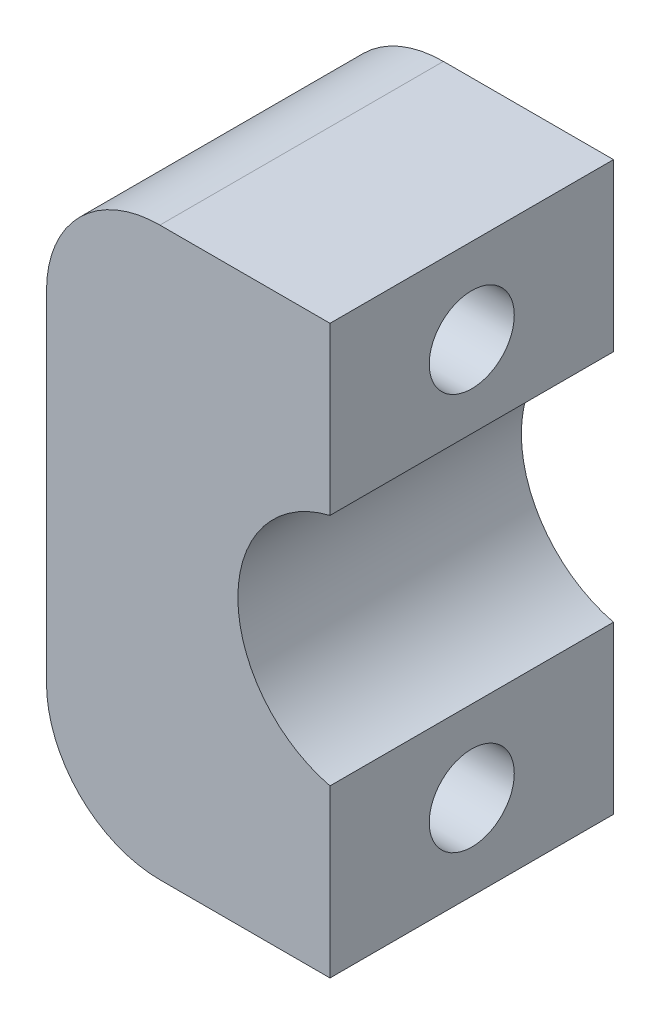
ISO-10303-21;
HEADER;
FILE_DESCRIPTION(('STEP AP214'),'2;1');
FILE_NAME('part.step','',(''),(''),'','','');
FILE_SCHEMA(('AUTOMOTIVE_DESIGN { 1 0 10303 214 1 1 1 1 }'));
ENDSEC;
DATA;
#1=APPLICATION_CONTEXT('core data for automotive mechanical design processes');
#2=APPLICATION_PROTOCOL_DEFINITION('international standard','automotive_design',2000,#1);
#3=PRODUCT_CONTEXT('',#1,'mechanical');
#4=PRODUCT('Part','Part','',(#3));
#5=PRODUCT_RELATED_PRODUCT_CATEGORY('part','',(#4));
#6=PRODUCT_DEFINITION_FORMATION('','',#4);
#7=PRODUCT_DEFINITION_CONTEXT('part definition',#1,'design');
#8=PRODUCT_DEFINITION('design','',#6,#7);
#9=PRODUCT_DEFINITION_SHAPE('','',#8);
#10=(LENGTH_UNIT() NAMED_UNIT(*) SI_UNIT(.MILLI.,.METRE.));
#11=(NAMED_UNIT(*) PLANE_ANGLE_UNIT() SI_UNIT($,.RADIAN.));
#12=(NAMED_UNIT(*) SI_UNIT($,.STERADIAN.) SOLID_ANGLE_UNIT());
#13=UNCERTAINTY_MEASURE_WITH_UNIT(LENGTH_MEASURE(1.E-05),#10,'distance_accuracy_value','');
#14=(GEOMETRIC_REPRESENTATION_CONTEXT(3) GLOBAL_UNCERTAINTY_ASSIGNED_CONTEXT((#13)) GLOBAL_UNIT_ASSIGNED_CONTEXT((#10,
#11,#12)) REPRESENTATION_CONTEXT('',''));
#15=CARTESIAN_POINT('',(0.,0.,0.));
#16=DIRECTION('',(0.,0.,1.));
#17=DIRECTION('',(1.,0.,0.));
#18=AXIS2_PLACEMENT_3D('',#15,#16,#17);
#19=CARTESIAN_POINT('',(5.,20.,5.));
#20=DIRECTION('',(-1.,0.,0.));
#21=DIRECTION('',(0.,0.,1.));
#22=AXIS2_PLACEMENT_3D('',#19,#20,#21);
#23=PLANE('',#22);
#24=CARTESIAN_POINT('',(5.,3.,0.));
#25=DIRECTION('',(1.,0.,0.));
#26=DIRECTION('',(0.,0.,-1.));
#27=AXIS2_PLACEMENT_3D('',#24,#25,#26);
#28=CIRCLE('',#27,1.5);
#29=CARTESIAN_POINT('',(5.,3.,-1.5));
#30=VERTEX_POINT('',#29);
#31=EDGE_CURVE('E228',#30,#30,#28,.T.);
#32=ORIENTED_EDGE('',*,*,#31,.F.);
#33=EDGE_LOOP('',(#32));
#34=FACE_BOUND('',#33,.T.);
#35=DIRECTION('',(0.,-1.,0.));
#36=VECTOR('',#35,1.);
#37=CARTESIAN_POINT('',(5.,20.,-5.));
#38=LINE('',#37,#36);
#39=CARTESIAN_POINT('',(5.,5.86932208953542,-5.));
#40=VERTEX_POINT('',#39);
#41=CARTESIAN_POINT('',(5.,0.,-5.));
#42=VERTEX_POINT('',#41);
#43=EDGE_CURVE('E140',#40,#42,#38,.T.);
#44=ORIENTED_EDGE('',*,*,#43,.F.);
#45=DIRECTION('',(0.,0.,1.));
#46=VECTOR('',#45,1.);
#47=CARTESIAN_POINT('',(5.,5.86932208953542,-5.));
#48=LINE('',#47,#46);
#49=CARTESIAN_POINT('',(5.,5.86932208953542,5.));
#50=VERTEX_POINT('',#49);
#51=EDGE_CURVE('E121',#40,#50,#48,.T.);
#52=ORIENTED_EDGE('',*,*,#51,.T.);
#53=DIRECTION('',(0.,-1.,0.));
#54=VECTOR('',#53,1.);
#55=CARTESIAN_POINT('',(5.,20.,5.));
#56=LINE('',#55,#54);
#57=CARTESIAN_POINT('',(5.,0.,5.));
#58=VERTEX_POINT('',#57);
#59=EDGE_CURVE('E139',#50,#58,#56,.T.);
#60=ORIENTED_EDGE('',*,*,#59,.T.);
#61=DIRECTION('',(0.,0.,-1.));
#62=VECTOR('',#61,1.);
#63=CARTESIAN_POINT('',(5.,0.,5.));
#64=LINE('',#63,#62);
#65=EDGE_CURVE('E243',#58,#42,#64,.T.);
#66=ORIENTED_EDGE('',*,*,#65,.T.);
#67=EDGE_LOOP('',(#44,#52,#60,#66));
#68=FACE_BOUND('',#67,.T.);
#69=ADVANCED_FACE('F37',(#34,#68),#23,.F.);
#70=CARTESIAN_POINT('',(-5.,20.,5.));
#71=DIRECTION('',(1.,0.,0.));
#72=DIRECTION('',(0.,0.,-1.));
#73=AXIS2_PLACEMENT_3D('',#70,#71,#72);
#74=PLANE('',#73);
#75=DIRECTION('',(0.,-1.,0.));
#76=VECTOR('',#75,1.);
#77=CARTESIAN_POINT('',(-5.,20.,5.));
#78=LINE('',#77,#76);
#79=CARTESIAN_POINT('',(-5.,16.,5.));
#80=VERTEX_POINT('',#79);
#81=CARTESIAN_POINT('',(-5.,4.,5.));
#82=VERTEX_POINT('',#81);
#83=EDGE_CURVE('E148',#80,#82,#78,.T.);
#84=ORIENTED_EDGE('',*,*,#83,.F.);
#85=DIRECTION('',(0.,0.,1.));
#86=VECTOR('',#85,1.);
#87=CARTESIAN_POINT('',(-5.,16.,-5.));
#88=LINE('',#87,#86);
#89=CARTESIAN_POINT('',(-5.,16.,1.1180339887499));
#90=VERTEX_POINT('',#89);
#91=EDGE_CURVE('E165',#80,#90,#88,.F.);
#92=ORIENTED_EDGE('',*,*,#91,.T.);
#93=CARTESIAN_POINT('',(-5.,17.,0.));
#94=DIRECTION('',(1.,0.,0.));
#95=DIRECTION('',(0.,0.,-1.));
#96=AXIS2_PLACEMENT_3D('',#93,#94,#95);
#97=CIRCLE('',#96,1.5);
#98=CARTESIAN_POINT('',(-5.,16.,-1.1180339887499));
#99=VERTEX_POINT('',#98);
#100=EDGE_CURVE('E224',#90,#99,#97,.T.);
#101=ORIENTED_EDGE('',*,*,#100,.T.);
#102=DIRECTION('',(0.,0.,1.));
#103=VECTOR('',#102,1.);
#104=CARTESIAN_POINT('',(-5.,16.,-5.));
#105=LINE('',#104,#103);
#106=CARTESIAN_POINT('',(-5.,16.,-5.));
#107=VERTEX_POINT('',#106);
#108=EDGE_CURVE('E163',#99,#107,#105,.F.);
#109=ORIENTED_EDGE('',*,*,#108,.T.);
#110=DIRECTION('',(0.,-1.,0.));
#111=VECTOR('',#110,1.);
#112=CARTESIAN_POINT('',(-5.,20.,-5.));
#113=LINE('',#112,#111);
#114=CARTESIAN_POINT('',(-5.,4.,-5.));
#115=VERTEX_POINT('',#114);
#116=EDGE_CURVE('E144',#107,#115,#113,.T.);
#117=ORIENTED_EDGE('',*,*,#116,.T.);
#118=DIRECTION('',(0.,0.,1.));
#119=VECTOR('',#118,1.);
#120=CARTESIAN_POINT('',(-5.,4.,5.));
#121=LINE('',#120,#119);
#122=CARTESIAN_POINT('',(-5.,4.,-1.11803398874989));
#123=VERTEX_POINT('',#122);
#124=EDGE_CURVE('E160',#115,#123,#121,.T.);
#125=ORIENTED_EDGE('',*,*,#124,.T.);
#126=CARTESIAN_POINT('',(-5.,3.,0.));
#127=DIRECTION('',(1.,0.,0.));
#128=DIRECTION('',(0.,0.,-1.));
#129=AXIS2_PLACEMENT_3D('',#126,#127,#128);
#130=CIRCLE('',#129,1.5);
#131=CARTESIAN_POINT('',(-5.,4.,1.11803398874989));
#132=VERTEX_POINT('',#131);
#133=EDGE_CURVE('E232',#123,#132,#130,.T.);
#134=ORIENTED_EDGE('',*,*,#133,.T.);
#135=DIRECTION('',(0.,0.,1.));
#136=VECTOR('',#135,1.);
#137=CARTESIAN_POINT('',(-5.,4.,5.));
#138=LINE('',#137,#136);
#139=EDGE_CURVE('E158',#132,#82,#138,.T.);
#140=ORIENTED_EDGE('',*,*,#139,.T.);
#141=EDGE_LOOP('',(#84,#92,#101,#109,#117,#125,#134,#140));
#142=FACE_BOUND('',#141,.T.);
#143=ADVANCED_FACE('F202',(#142),#74,.F.);
#144=CARTESIAN_POINT('',(5.,20.,5.));
#145=DIRECTION('',(0.,0.,-1.));
#146=DIRECTION('',(-1.,0.,0.));
#147=AXIS2_PLACEMENT_3D('',#144,#145,#146);
#148=PLANE('',#147);
#149=DIRECTION('',(1.,0.,0.));
#150=VECTOR('',#149,1.);
#151=CARTESIAN_POINT('',(5.,20.,5.));
#152=LINE('',#151,#150);
#153=CARTESIAN_POINT('',(-1.,20.,5.));
#154=VERTEX_POINT('',#153);
#155=CARTESIAN_POINT('',(5.,20.,5.));
#156=VERTEX_POINT('',#155);
#157=EDGE_CURVE('E236',#154,#156,#152,.T.);
#158=ORIENTED_EDGE('',*,*,#157,.F.);
#159=CARTESIAN_POINT('',(-1.,16.,5.));
#160=DIRECTION('',(0.,0.,-1.));
#161=DIRECTION('',(-1.,0.,0.));
#162=AXIS2_PLACEMENT_3D('',#159,#160,#161);
#163=CIRCLE('',#162,4.);
#164=EDGE_CURVE('E156',#154,#80,#163,.F.);
#165=ORIENTED_EDGE('',*,*,#164,.T.);
#166=ORIENTED_EDGE('',*,*,#83,.T.);
#167=CARTESIAN_POINT('',(-1.,4.,5.));
#168=DIRECTION('',(0.,0.,-1.));
#169=DIRECTION('',(-1.,0.,0.));
#170=AXIS2_PLACEMENT_3D('',#167,#168,#169);
#171=CIRCLE('',#170,4.);
#172=CARTESIAN_POINT('',(-1.,0.,5.));
#173=VERTEX_POINT('',#172);
#174=EDGE_CURVE('E154',#82,#173,#171,.F.);
#175=ORIENTED_EDGE('',*,*,#174,.T.);
#176=DIRECTION('',(1.,0.,0.));
#177=VECTOR('',#176,1.);
#178=CARTESIAN_POINT('',(5.,0.,5.));
#179=LINE('',#178,#177);
#180=EDGE_CURVE('E235',#173,#58,#179,.T.);
#181=ORIENTED_EDGE('',*,*,#180,.T.);
#182=ORIENTED_EDGE('',*,*,#59,.F.);
#183=CARTESIAN_POINT('',(6.,10.,5.));
#184=DIRECTION('',(0.,0.,1.));
#185=DIRECTION('',(1.,0.,0.));
#186=AXIS2_PLACEMENT_3D('',#183,#184,#185);
#187=CIRCLE('',#186,4.25);
#188=CARTESIAN_POINT('',(5.,14.1306779104646,5.));
#189=VERTEX_POINT('',#188);
#190=EDGE_CURVE('E124',#189,#50,#187,.T.);
#191=ORIENTED_EDGE('',*,*,#190,.F.);
#192=EDGE_CURVE('E134',#156,#189,#56,.T.);
#193=ORIENTED_EDGE('',*,*,#192,.F.);
#194=EDGE_LOOP('',(#158,#165,#166,#175,#181,#182,#191,#193));
#195=FACE_BOUND('',#194,.T.);
#196=ADVANCED_FACE('F199',(#195),#148,.F.);
#197=CARTESIAN_POINT('',(5.,17.,0.));
#198=DIRECTION('',(1.,0.,0.));
#199=DIRECTION('',(0.,0.,-1.));
#200=AXIS2_PLACEMENT_3D('',#197,#198,#199);
#201=CIRCLE('',#200,1.5);
#202=CARTESIAN_POINT('',(5.,17.,-1.5));
#203=VERTEX_POINT('',#202);
#204=EDGE_CURVE('E225',#203,#203,#201,.T.);
#205=ORIENTED_EDGE('',*,*,#204,.F.);
#206=EDGE_LOOP('',(#205));
#207=FACE_BOUND('',#206,.T.);
#208=ORIENTED_EDGE('',*,*,#192,.T.);
#209=DIRECTION('',(0.,0.,1.));
#210=VECTOR('',#209,1.);
#211=CARTESIAN_POINT('',(5.,14.1306779104646,-5.));
#212=LINE('',#211,#210);
#213=CARTESIAN_POINT('',(5.,14.1306779104646,-5.));
#214=VERTEX_POINT('',#213);
#215=EDGE_CURVE('E118',#189,#214,#212,.F.);
#216=ORIENTED_EDGE('',*,*,#215,.T.);
#217=CARTESIAN_POINT('',(5.,20.,-5.));
#218=VERTEX_POINT('',#217);
#219=EDGE_CURVE('E131',#218,#214,#38,.T.);
#220=ORIENTED_EDGE('',*,*,#219,.F.);
#221=DIRECTION('',(0.,0.,-1.));
#222=VECTOR('',#221,1.);
#223=CARTESIAN_POINT('',(5.,20.,5.));
#224=LINE('',#223,#222);
#225=EDGE_CURVE('E238',#156,#218,#224,.T.);
#226=ORIENTED_EDGE('',*,*,#225,.F.);
#227=EDGE_LOOP('',(#208,#216,#220,#226));
#228=FACE_BOUND('',#227,.T.);
#229=ADVANCED_FACE('F129',(#207,#228),#23,.F.);
#230=CARTESIAN_POINT('',(5.,20.,-5.));
#231=DIRECTION('',(0.,0.,1.));
#232=DIRECTION('',(1.,0.,0.));
#233=AXIS2_PLACEMENT_3D('',#230,#231,#232);
#234=PLANE('',#233);
#235=ORIENTED_EDGE('',*,*,#116,.F.);
#236=CARTESIAN_POINT('',(-1.,16.,-5.));
#237=DIRECTION('',(0.,0.,1.));
#238=DIRECTION('',(1.,0.,0.));
#239=AXIS2_PLACEMENT_3D('',#236,#237,#238);
#240=CIRCLE('',#239,4.);
#241=CARTESIAN_POINT('',(-1.,20.,-5.));
#242=VERTEX_POINT('',#241);
#243=EDGE_CURVE('E248',#107,#242,#240,.F.);
#244=ORIENTED_EDGE('',*,*,#243,.T.);
#245=DIRECTION('',(-1.,0.,0.));
#246=VECTOR('',#245,1.);
#247=CARTESIAN_POINT('',(5.,20.,-5.));
#248=LINE('',#247,#246);
#249=EDGE_CURVE('E138',#218,#242,#248,.T.);
#250=ORIENTED_EDGE('',*,*,#249,.F.);
#251=ORIENTED_EDGE('',*,*,#219,.T.);
#252=CARTESIAN_POINT('',(6.,10.,-5.));
#253=DIRECTION('',(0.,0.,1.));
#254=DIRECTION('',(1.,0.,0.));
#255=AXIS2_PLACEMENT_3D('',#252,#253,#254);
#256=CIRCLE('',#255,4.25);
#257=EDGE_CURVE('E115',#214,#40,#256,.T.);
#258=ORIENTED_EDGE('',*,*,#257,.T.);
#259=ORIENTED_EDGE('',*,*,#43,.T.);
#260=DIRECTION('',(-1.,0.,0.));
#261=VECTOR('',#260,1.);
#262=CARTESIAN_POINT('',(5.,0.,-5.));
#263=LINE('',#262,#261);
#264=CARTESIAN_POINT('',(-1.,0.,-5.));
#265=VERTEX_POINT('',#264);
#266=EDGE_CURVE('E239',#42,#265,#263,.T.);
#267=ORIENTED_EDGE('',*,*,#266,.T.);
#268=CARTESIAN_POINT('',(-1.,4.,-5.));
#269=DIRECTION('',(0.,0.,1.));
#270=DIRECTION('',(1.,0.,0.));
#271=AXIS2_PLACEMENT_3D('',#268,#269,#270);
#272=CIRCLE('',#271,4.);
#273=EDGE_CURVE('E58',#265,#115,#272,.F.);
#274=ORIENTED_EDGE('',*,*,#273,.T.);
#275=EDGE_LOOP('',(#235,#244,#250,#251,#258,#259,#267,#274));
#276=FACE_BOUND('',#275,.T.);
#277=ADVANCED_FACE('F136',(#276),#234,.F.);
#278=CARTESIAN_POINT('',(0.,20.,0.));
#279=DIRECTION('',(0.,1.,0.));
#280=DIRECTION('',(0.,0.,1.));
#281=AXIS2_PLACEMENT_3D('',#278,#279,#280);
#282=PLANE('',#281);
#283=ORIENTED_EDGE('',*,*,#249,.T.);
#284=DIRECTION('',(0.,0.,1.));
#285=VECTOR('',#284,1.);
#286=CARTESIAN_POINT('',(-1.,20.,5.));
#287=LINE('',#286,#285);
#288=EDGE_CURVE('E151',#242,#154,#287,.T.);
#289=ORIENTED_EDGE('',*,*,#288,.T.);
#290=ORIENTED_EDGE('',*,*,#157,.T.);
#291=ORIENTED_EDGE('',*,*,#225,.T.);
#292=EDGE_LOOP('',(#283,#289,#290,#291));
#293=FACE_BOUND('',#292,.T.);
#294=ADVANCED_FACE('F189',(#293),#282,.T.);
#295=CARTESIAN_POINT('',(0.,0.,0.));
#296=DIRECTION('',(0.,1.,0.));
#297=DIRECTION('',(0.,0.,1.));
#298=AXIS2_PLACEMENT_3D('',#295,#296,#297);
#299=PLANE('',#298);
#300=ORIENTED_EDGE('',*,*,#180,.F.);
#301=DIRECTION('',(0.,0.,1.));
#302=VECTOR('',#301,1.);
#303=CARTESIAN_POINT('',(-1.,0.,0.));
#304=LINE('',#303,#302);
#305=EDGE_CURVE('E11',#173,#265,#304,.F.);
#306=ORIENTED_EDGE('',*,*,#305,.T.);
#307=ORIENTED_EDGE('',*,*,#266,.F.);
#308=ORIENTED_EDGE('',*,*,#65,.F.);
#309=EDGE_LOOP('',(#300,#306,#307,#308));
#310=FACE_BOUND('',#309,.T.);
#311=ADVANCED_FACE('F188',(#310),#299,.F.);
#312=CARTESIAN_POINT('',(6.,10.,-5.));
#313=DIRECTION('',(0.,0.,1.));
#314=DIRECTION('',(1.,0.,0.));
#315=AXIS2_PLACEMENT_3D('',#312,#313,#314);
#316=CYLINDRICAL_SURFACE('',#315,4.25);
#317=ORIENTED_EDGE('',*,*,#257,.F.);
#318=ORIENTED_EDGE('',*,*,#215,.F.);
#319=ORIENTED_EDGE('',*,*,#190,.T.);
#320=ORIENTED_EDGE('',*,*,#51,.F.);
#321=EDGE_LOOP('',(#317,#318,#319,#320));
#322=FACE_BOUND('',#321,.T.);
#323=ADVANCED_FACE('F117',(#322),#316,.F.);
#324=CARTESIAN_POINT('',(-5.,17.,0.));
#325=DIRECTION('',(1.,0.,0.));
#326=DIRECTION('',(0.,0.,-1.));
#327=AXIS2_PLACEMENT_3D('',#324,#325,#326);
#328=CYLINDRICAL_SURFACE('',#327,1.5);
#329=ORIENTED_EDGE('',*,*,#100,.F.);
#330=CARTESIAN_POINT('',(-5.,16.,1.1180339887499));
#331=CARTESIAN_POINT('',(-5.00000022119775,16.0301472354193,1.1449986596154));
#332=CARTESIAN_POINT('',(-4.9996586547776,16.0613733970829,1.1707315150769));
#333=CARTESIAN_POINT('',(-4.99815165725793,16.1257902084972,1.21958733550074));
#334=CARTESIAN_POINT('',(-4.99698614585624,16.1589810494377,1.24271004582205));
#335=CARTESIAN_POINT('',(-4.99204914070297,16.2610805053327,1.30785888402432));
#336=CARTESIAN_POINT('',(-4.98683816564392,16.3326243679681,1.34576238111664));
#337=CARTESIAN_POINT('',(-4.97172941371885,16.4805189745722,1.4094819468788));
#338=CARTESIAN_POINT('',(-4.96182554652281,16.5568758528011,1.43528222142185));
#339=CARTESIAN_POINT('',(-4.93692067545343,16.71190629951,1.47424015670582));
#340=CARTESIAN_POINT('',(-4.92192227781528,16.790578664686,1.48740426864538));
#341=CARTESIAN_POINT('',(-4.88702718487261,16.9473248318172,1.50112474564526));
#342=CARTESIAN_POINT('',(-4.8671656116747,17.0253989589847,1.50176896089076));
#343=CARTESIAN_POINT('',(-4.8229933446876,17.1794718386795,1.49122752467265));
#344=CARTESIAN_POINT('',(-4.7986802168678,17.2554694295394,1.48003538523287));
#345=CARTESIAN_POINT('',(-4.74493337665097,17.4079709236681,1.44568953899924));
#346=CARTESIAN_POINT('',(-4.71528512136644,17.4842509138375,1.42188277053331));
#347=CARTESIAN_POINT('',(-4.65319458606603,17.6311153258216,1.36306932159568));
#348=CARTESIAN_POINT('',(-4.62075161519092,17.7016983309294,1.32805986595777));
#349=CARTESIAN_POINT('',(-4.55091225478773,17.8433406390253,1.24350115665281));
#350=CARTESIAN_POINT('',(-4.51335889074114,17.9136311293903,1.19279138821912));
#351=CARTESIAN_POINT('',(-4.43872137132709,18.0447245972482,1.07983767727731));
#352=CARTESIAN_POINT('',(-4.40163794818834,18.1055141252558,1.01757765197095));
#353=CARTESIAN_POINT('',(-4.32853406273424,18.2193903184475,0.878430228684703));
#354=CARTESIAN_POINT('',(-4.29270119801716,18.2718224308868,0.800902238815065));
#355=CARTESIAN_POINT('',(-4.22850332321898,18.3621706095598,0.635092518520685));
#356=CARTESIAN_POINT('',(-4.2001178546376,18.4001265758606,0.54684124387886));
#357=CARTESIAN_POINT('',(-4.16218540099348,18.4497420964714,0.390789649514078));
#358=CARTESIAN_POINT('',(-4.14952496994344,18.4659090338344,0.325169173811443));
#359=CARTESIAN_POINT('',(-4.13108993667224,18.4892777820119,0.191426328657126));
#360=CARTESIAN_POINT('',(-4.12530772612916,18.4964894990037,0.123306809688897));
#361=CARTESIAN_POINT('',(-4.12129440037009,18.5015062876114,-0.0136651647102532));
#362=CARTESIAN_POINT('',(-4.1230809059247,18.4992894084127,-0.0825189578128557));
#363=CARTESIAN_POINT('',(-4.13402533335742,18.4855497570238,-0.218703818834312));
#364=CARTESIAN_POINT('',(-4.14318716759518,18.4740220457449,-0.28603405906623));
#365=CARTESIAN_POINT('',(-4.16757578167227,18.4427117848218,-0.415867536051533));
#366=CARTESIAN_POINT('',(-4.18265938444092,18.4231236190427,-0.47844586371281));
#367=CARTESIAN_POINT('',(-4.21756557986445,18.3765764138889,-0.59936661036021));
#368=CARTESIAN_POINT('',(-4.23738983527228,18.3496147878435,-0.657707533723138));
#369=CARTESIAN_POINT('',(-4.28378468012632,18.2844239279232,-0.778237607114462));
#370=CARTESIAN_POINT('',(-4.31092518127944,18.2450934572255,-0.839609161776513));
#371=CARTESIAN_POINT('',(-4.36787452305173,18.1587269884118,-0.955285619457794));
#372=CARTESIAN_POINT('',(-4.39768533260032,18.1116852829134,-1.00958523443565));
#373=CARTESIAN_POINT('',(-4.46443386773047,18.0006684753754,-1.12071100554385));
#374=CARTESIAN_POINT('',(-4.50161105146883,17.9351858738484,-1.17589664120707));
#375=CARTESIAN_POINT('',(-4.57524832125866,17.7955059435488,-1.27455348846475));
#376=CARTESIAN_POINT('',(-4.61170794273817,17.721303172584,-1.3180173282315));
#377=CARTESIAN_POINT('',(-4.6843499569096,17.5600946693997,-1.39455595464622));
#378=CARTESIAN_POINT('',(-4.72034061460376,17.4725592875636,-1.42670998672802));
#379=CARTESIAN_POINT('',(-4.78710036380514,17.291193594396,-1.47444177871588));
#380=CARTESIAN_POINT('',(-4.81787337152072,17.1973680787199,-1.49003201759954));
#381=CARTESIAN_POINT('',(-4.8702723630493,17.0145278298705,-1.5024861213145));
#382=CARTESIAN_POINT('',(-4.89245026890391,16.9257729746025,-1.50081586106394));
#383=CARTESIAN_POINT('',(-4.9303638084902,16.7486164446103,-1.48146141771453));
#384=CARTESIAN_POINT('',(-4.94610241855436,16.6602146254609,-1.46378464521703));
#385=CARTESIAN_POINT('',(-4.96993477191657,16.495823677847,-1.41507022665776));
#386=CARTESIAN_POINT('',(-4.97863141212214,16.4194724673344,-1.3855297087446));
#387=CARTESIAN_POINT('',(-4.99139887472082,16.27234923917,-1.31422390942448));
#388=CARTESIAN_POINT('',(-4.99547560142535,16.2015702081535,-1.27247431746938));
#389=CARTESIAN_POINT('',(-4.99852276804927,16.1112387676309,-1.2086915924151));
#390=CARTESIAN_POINT('',(-4.99909011019411,16.0882428997008,-1.19143932092378));
#391=CARTESIAN_POINT('',(-4.99982801720677,16.0433200530381,-1.15567444163813));
#392=CARTESIAN_POINT('',(-4.99999935981009,16.0213910620886,-1.1371643778907));
#393=CARTESIAN_POINT('',(-5.00000000000001,16.,-1.1180339887499));
#394=B_SPLINE_CURVE_WITH_KNOTS('',3,(#330,#331,#332,#333,#334,#335,#336,#337,#338,#339,#340,
#341,#342,#343,#344,#345,#346,#347,#348,#349,#350,#351,#352,#353,#354,#355,#356,#357,#358,#359,
#360,#361,#362,#363,#364,#365,#366,#367,#368,#369,#370,#371,#372,#373,#374,#375,#376,#377,#378,
#379,#380,#381,#382,#383,#384,#385,#386,#387,#388,#389,#390,#391,#392,#393),.UNSPECIFIED.,.F.,
.F.,(4,2,2,2,2,2,2,2,2,2,2,2,2,2,2,2,2,2,2,2,2,2,2,2,2,2,2,2,2,2,2,4),(0.,0.121270804252288,
0.242553429258347,0.484688620106601,0.727138912826481,0.969465360337442,1.21009082180609,
1.45084824804437,1.70550056190527,1.96021600796838,2.24238846114128,2.52495680646648,
2.82397708007851,3.12216711420394,3.32758248913295,3.53277043257514,3.73843633740828,
3.94421141291872,4.14529057535962,4.34644036871567,4.57894336728253,4.81161923378278,
5.09051195982657,5.36957967441565,5.6678515817297,5.96589861461178,6.23885668817008,
6.51168845377318,6.75749124117009,7.00297953378055,7.0892038085405,7.17525859604404),.UNSPECIFIED.);
#395=EDGE_CURVE('E167',#90,#99,#394,.T.);
#396=ORIENTED_EDGE('',*,*,#395,.T.);
#397=EDGE_LOOP('',(#329,#396));
#398=FACE_BOUND('',#397,.T.);
#399=ORIENTED_EDGE('',*,*,#204,.T.);
#400=EDGE_LOOP('',(#399));
#401=FACE_BOUND('',#400,.T.);
#402=ADVANCED_FACE('F178',(#398,#401),#328,.F.);
#403=CARTESIAN_POINT('',(-5.,3.,0.));
#404=DIRECTION('',(1.,0.,0.));
#405=DIRECTION('',(0.,0.,-1.));
#406=AXIS2_PLACEMENT_3D('',#403,#404,#405);
#407=CYLINDRICAL_SURFACE('',#406,1.5);
#408=ORIENTED_EDGE('',*,*,#133,.F.);
#409=CARTESIAN_POINT('',(-5.,4.,-1.11803398874989));
#410=CARTESIAN_POINT('',(-5.00000022119775,3.96985276458074,-1.1449986596154));
#411=CARTESIAN_POINT('',(-4.9996586547776,3.93862660291712,-1.17073151507689));
#412=CARTESIAN_POINT('',(-4.99815165725793,3.87420979150282,-1.21958733550074));
#413=CARTESIAN_POINT('',(-4.99698614585624,3.84101895056226,-1.24271004582205));
#414=CARTESIAN_POINT('',(-4.99204914070297,3.73891949466728,-1.30785888402432));
#415=CARTESIAN_POINT('',(-4.98683816564392,3.66737563203189,-1.34576238111663));
#416=CARTESIAN_POINT('',(-4.97172941371885,3.51948102542777,-1.4094819468788));
#417=CARTESIAN_POINT('',(-4.96182554652281,3.44312414719887,-1.43528222142185));
#418=CARTESIAN_POINT('',(-4.93692067545343,3.28809370049002,-1.47424015670582));
#419=CARTESIAN_POINT('',(-4.92192227781528,3.20942133531402,-1.48740426864538));
#420=CARTESIAN_POINT('',(-4.88702718487261,3.05267516818278,-1.50112474564525));
#421=CARTESIAN_POINT('',(-4.8671656116747,2.9746010410153,-1.50176896089076));
#422=CARTESIAN_POINT('',(-4.8229933446876,2.82052816132047,-1.49122752467265));
#423=CARTESIAN_POINT('',(-4.79868021686781,2.74453057046056,-1.48003538523287));
#424=CARTESIAN_POINT('',(-4.74493337665097,2.59202907633194,-1.44568953899924));
#425=CARTESIAN_POINT('',(-4.71528512136645,2.51574908616253,-1.42188277053331));
#426=CARTESIAN_POINT('',(-4.65319458606603,2.36888467417845,-1.36306932159568));
#427=CARTESIAN_POINT('',(-4.62075161519093,2.29830166907058,-1.32805986595777));
#428=CARTESIAN_POINT('',(-4.55091225478773,2.15665936097471,-1.2435011566528));
#429=CARTESIAN_POINT('',(-4.51335889074114,2.08636887060969,-1.19279138821912));
#430=CARTESIAN_POINT('',(-4.43872137132709,1.95527540275183,-1.07983767727731));
#431=CARTESIAN_POINT('',(-4.40163794818834,1.89448587474417,-1.01757765197095));
#432=CARTESIAN_POINT('',(-4.32853406273424,1.78060968155252,-0.878430228684705));
#433=CARTESIAN_POINT('',(-4.29270119801716,1.72817756911324,-0.800902238815067));
#434=CARTESIAN_POINT('',(-4.22850332321898,1.63782939044017,-0.635092518520688));
#435=CARTESIAN_POINT('',(-4.2001178546376,1.59987342413944,-0.546841243878863));
#436=CARTESIAN_POINT('',(-4.16218540099348,1.55025790352856,-0.39078964951408));
#437=CARTESIAN_POINT('',(-4.14952496994344,1.53409096616558,-0.325169173811444));
#438=CARTESIAN_POINT('',(-4.13108993667224,1.51072221798806,-0.191426328657128));
#439=CARTESIAN_POINT('',(-4.12530772612916,1.5035105009963,-0.123306809688899));
#440=CARTESIAN_POINT('',(-4.12129440037009,1.49849371238861,0.013665164710251));
#441=CARTESIAN_POINT('',(-4.1230809059247,1.50071059158732,0.0825189578128536));
#442=CARTESIAN_POINT('',(-4.13402533335742,1.51445024297616,0.21870381883431));
#443=CARTESIAN_POINT('',(-4.14318716759518,1.52597795425512,0.286034059066227));
#444=CARTESIAN_POINT('',(-4.16757578167227,1.55728821517819,0.41586753605153));
#445=CARTESIAN_POINT('',(-4.18265938444092,1.57687638095729,0.478445863712807));
#446=CARTESIAN_POINT('',(-4.21756557986445,1.62342358611113,0.599366610360208));
#447=CARTESIAN_POINT('',(-4.23738983527228,1.65038521215653,0.657707533723136));
#448=CARTESIAN_POINT('',(-4.28378468012632,1.71557607207684,0.778237607114461));
#449=CARTESIAN_POINT('',(-4.31092518127944,1.75490654277445,0.839609161776513));
#450=CARTESIAN_POINT('',(-4.36787452305173,1.84127301158818,0.955285619457793));
#451=CARTESIAN_POINT('',(-4.39768533260032,1.88831471708662,1.00958523443565));
#452=CARTESIAN_POINT('',(-4.46443386773047,1.9993315246246,1.12071100554385));
#453=CARTESIAN_POINT('',(-4.50161105146883,2.06481412615157,1.17589664120707));
#454=CARTESIAN_POINT('',(-4.57524832125866,2.20449405645121,1.27455348846475));
#455=CARTESIAN_POINT('',(-4.61170794273816,2.27869682741598,1.3180173282315));
#456=CARTESIAN_POINT('',(-4.6843499569096,2.43990533060025,1.39455595464622));
#457=CARTESIAN_POINT('',(-4.72034061460376,2.52744071243637,1.42670998672802));
#458=CARTESIAN_POINT('',(-4.78710036380514,2.708806405604,1.47444177871588));
#459=CARTESIAN_POINT('',(-4.81787337152072,2.80263192128008,1.49003201759954));
#460=CARTESIAN_POINT('',(-4.8702723630493,2.98547217012948,1.5024861213145));
#461=CARTESIAN_POINT('',(-4.89245026890391,3.07422702539746,1.50081586106394));
#462=CARTESIAN_POINT('',(-4.9303638084902,3.2513835553897,1.48146141771453));
#463=CARTESIAN_POINT('',(-4.94610241855436,3.33978537453914,1.46378464521703));
#464=CARTESIAN_POINT('',(-4.96993477191657,3.50417632215299,1.41507022665776));
#465=CARTESIAN_POINT('',(-4.97863141212214,3.58052753266562,1.3855297087446));
#466=CARTESIAN_POINT('',(-4.99139887472082,3.72765076083001,1.31422390942448));
#467=CARTESIAN_POINT('',(-4.99547560142535,3.79842979184652,1.27247431746938));
#468=CARTESIAN_POINT('',(-4.99852276804927,3.88876123236907,1.2086915924151));
#469=CARTESIAN_POINT('',(-4.99909011019411,3.91175710029917,1.19143932092378));
#470=CARTESIAN_POINT('',(-4.99982801720677,3.95667994696193,1.15567444163813));
#471=CARTESIAN_POINT('',(-4.99999935981009,3.97860893791145,1.1371643778907));
#472=CARTESIAN_POINT('',(-5.00000000000001,4.00000000000001,1.1180339887499));
#473=B_SPLINE_CURVE_WITH_KNOTS('',3,(#409,#410,#411,#412,#413,#414,#415,#416,#417,#418,#419,
#420,#421,#422,#423,#424,#425,#426,#427,#428,#429,#430,#431,#432,#433,#434,#435,#436,#437,#438,
#439,#440,#441,#442,#443,#444,#445,#446,#447,#448,#449,#450,#451,#452,#453,#454,#455,#456,#457,
#458,#459,#460,#461,#462,#463,#464,#465,#466,#467,#468,#469,#470,#471,#472),.UNSPECIFIED.,.F.,
.F.,(4,2,2,2,2,2,2,2,2,2,2,2,2,2,2,2,2,2,2,2,2,2,2,2,2,2,2,2,2,2,2,4),(0.,0.121270804252285,
0.242553429258344,0.4846886201066,0.727138912826485,0.969465360337441,1.21009082180609,
1.45084824804436,1.70550056190527,1.96021600796838,2.24238846114127,2.52495680646648,
2.82397708007851,3.12216711420394,3.32758248913294,3.53277043257513,3.73843633740827,
3.94421141291871,4.14529057535962,4.34644036871567,4.57894336728252,4.81161923378278,
5.09051195982656,5.36957967441564,5.66785158172969,5.96589861461177,6.23885668817007,
6.51168845377317,6.75749124117008,7.00297953378054,7.0892038085405,7.17525859604403),.UNSPECIFIED.);
#474=EDGE_CURVE('E46',#123,#132,#473,.T.);
#475=ORIENTED_EDGE('',*,*,#474,.T.);
#476=EDGE_LOOP('',(#408,#475));
#477=FACE_BOUND('',#476,.T.);
#478=ORIENTED_EDGE('',*,*,#31,.T.);
#479=EDGE_LOOP('',(#478));
#480=FACE_BOUND('',#479,.T.);
#481=ADVANCED_FACE('F183',(#477,#480),#407,.F.);
#482=CARTESIAN_POINT('',(-1.,16.,0.));
#483=DIRECTION('',(0.,0.,-1.));
#484=DIRECTION('',(-1.,0.,0.));
#485=AXIS2_PLACEMENT_3D('',#482,#483,#484);
#486=CYLINDRICAL_SURFACE('',#485,4.);
#487=ORIENTED_EDGE('',*,*,#395,.F.);
#488=ORIENTED_EDGE('',*,*,#91,.F.);
#489=ORIENTED_EDGE('',*,*,#164,.F.);
#490=ORIENTED_EDGE('',*,*,#288,.F.);
#491=ORIENTED_EDGE('',*,*,#243,.F.);
#492=ORIENTED_EDGE('',*,*,#108,.F.);
#493=EDGE_LOOP('',(#487,#488,#489,#490,#491,#492));
#494=FACE_BOUND('',#493,.T.);
#495=ADVANCED_FACE('F175',(#494),#486,.T.);
#496=CARTESIAN_POINT('',(-1.,4.,5.));
#497=DIRECTION('',(0.,0.,1.));
#498=DIRECTION('',(1.,0.,0.));
#499=AXIS2_PLACEMENT_3D('',#496,#497,#498);
#500=CYLINDRICAL_SURFACE('',#499,4.);
#501=ORIENTED_EDGE('',*,*,#273,.F.);
#502=ORIENTED_EDGE('',*,*,#305,.F.);
#503=ORIENTED_EDGE('',*,*,#174,.F.);
#504=ORIENTED_EDGE('',*,*,#139,.F.);
#505=ORIENTED_EDGE('',*,*,#474,.F.);
#506=ORIENTED_EDGE('',*,*,#124,.F.);
#507=EDGE_LOOP('',(#501,#502,#503,#504,#505,#506));
#508=FACE_BOUND('',#507,.T.);
#509=ADVANCED_FACE('F39',(#508),#500,.T.);
#510=CLOSED_SHELL('',(#69,#143,#196,#229,#277,#294,#311,#323,#402,#481,#495,#509));
#511=MANIFOLD_SOLID_BREP('B2',#510);
#512=ADVANCED_BREP_SHAPE_REPRESENTATION('',(#18,#511),#14);
#513=SHAPE_DEFINITION_REPRESENTATION(#9,#512);
ENDSEC;
END-ISO-10303-21;
